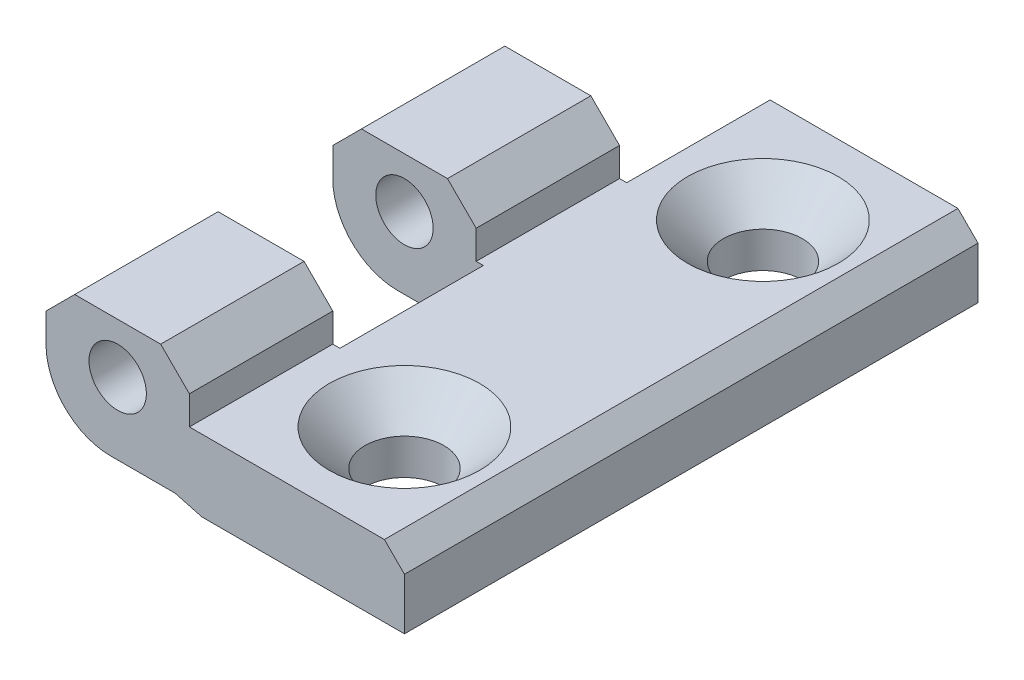
ISO-10303-21;
HEADER;
FILE_DESCRIPTION(('STEP AP214'),'2;1');
FILE_NAME('part.step','',(''),(''),'','','');
FILE_SCHEMA(('AUTOMOTIVE_DESIGN { 1 0 10303 214 1 1 1 1 }'));
ENDSEC;
DATA;
#1=APPLICATION_CONTEXT('core data for automotive mechanical design processes');
#2=APPLICATION_PROTOCOL_DEFINITION('international standard','automotive_design',2000,#1);
#3=PRODUCT_CONTEXT('',#1,'mechanical');
#4=PRODUCT('Part','Part','',(#3));
#5=PRODUCT_RELATED_PRODUCT_CATEGORY('part','',(#4));
#6=PRODUCT_DEFINITION_FORMATION('','',#4);
#7=PRODUCT_DEFINITION_CONTEXT('part definition',#1,'design');
#8=PRODUCT_DEFINITION('design','',#6,#7);
#9=PRODUCT_DEFINITION_SHAPE('','',#8);
#10=(LENGTH_UNIT() NAMED_UNIT(*) SI_UNIT(.MILLI.,.METRE.));
#11=(NAMED_UNIT(*) PLANE_ANGLE_UNIT() SI_UNIT($,.RADIAN.));
#12=(NAMED_UNIT(*) SI_UNIT($,.STERADIAN.) SOLID_ANGLE_UNIT());
#13=UNCERTAINTY_MEASURE_WITH_UNIT(LENGTH_MEASURE(1.E-05),#10,'distance_accuracy_value','');
#14=(GEOMETRIC_REPRESENTATION_CONTEXT(3) GLOBAL_UNCERTAINTY_ASSIGNED_CONTEXT((#13)) GLOBAL_UNIT_ASSIGNED_CONTEXT((#10,
#11,#12)) REPRESENTATION_CONTEXT('',''));
#15=CARTESIAN_POINT('',(0.,0.,0.));
#16=DIRECTION('',(0.,0.,1.));
#17=DIRECTION('',(1.,0.,0.));
#18=AXIS2_PLACEMENT_3D('',#15,#16,#17);
#19=CARTESIAN_POINT('',(-0.499999999999999,5.,-10.));
#20=DIRECTION('',(0.,0.,1.));
#21=DIRECTION('',(1.,0.,0.));
#22=AXIS2_PLACEMENT_3D('',#19,#20,#21);
#23=CYLINDRICAL_SURFACE('',#22,4.5);
#24=CARTESIAN_POINT('',(-0.499999999999999,5.,-10.));
#25=DIRECTION('',(0.,0.,1.));
#26=DIRECTION('',(1.,0.,0.));
#27=AXIS2_PLACEMENT_3D('',#24,#25,#26);
#28=CIRCLE('',#27,4.5);
#29=CARTESIAN_POINT('',(-0.5,0.5,-10.));
#30=VERTEX_POINT('',#29);
#31=CARTESIAN_POINT('',(-5.,5.,-10.));
#32=VERTEX_POINT('',#31);
#33=EDGE_CURVE('E19',#30,#32,#28,.F.);
#34=ORIENTED_EDGE('',*,*,#33,.F.);
#35=DIRECTION('',(0.,0.,1.));
#36=VECTOR('',#35,1.);
#37=CARTESIAN_POINT('',(-0.5,0.5,-10.));
#38=LINE('',#37,#36);
#39=CARTESIAN_POINT('',(-0.5,0.5,0.));
#40=VERTEX_POINT('',#39);
#41=EDGE_CURVE('E120',#30,#40,#38,.T.);
#42=ORIENTED_EDGE('',*,*,#41,.T.);
#43=CARTESIAN_POINT('',(-0.499999999999999,5.,0.));
#44=DIRECTION('',(0.,0.,1.));
#45=DIRECTION('',(1.,0.,0.));
#46=AXIS2_PLACEMENT_3D('',#43,#44,#45);
#47=CIRCLE('',#46,4.5);
#48=CARTESIAN_POINT('',(-5.,5.,0.));
#49=VERTEX_POINT('',#48);
#50=EDGE_CURVE('E195',#40,#49,#47,.F.);
#51=ORIENTED_EDGE('',*,*,#50,.T.);
#52=DIRECTION('',(0.,0.,-1.));
#53=VECTOR('',#52,1.);
#54=CARTESIAN_POINT('',(-5.,5.,-10.));
#55=LINE('',#54,#53);
#56=EDGE_CURVE('E122',#49,#32,#55,.T.);
#57=ORIENTED_EDGE('',*,*,#56,.T.);
#58=EDGE_LOOP('',(#34,#42,#51,#57));
#59=FACE_BOUND('',#58,.T.);
#60=ADVANCED_FACE('F16',(#59),#23,.T.);
#61=CARTESIAN_POINT('',(-5.,5.,-10.));
#62=DIRECTION('',(1.,0.,0.));
#63=DIRECTION('',(0.,0.,-1.));
#64=AXIS2_PLACEMENT_3D('',#61,#62,#63);
#65=PLANE('',#64);
#66=DIRECTION('',(0.,0.,1.));
#67=VECTOR('',#66,1.);
#68=CARTESIAN_POINT('',(-5.,7.,-10.));
#69=LINE('',#68,#67);
#70=CARTESIAN_POINT('',(-5.,7.,0.));
#71=VERTEX_POINT('',#70);
#72=CARTESIAN_POINT('',(-5.,7.,-10.));
#73=VERTEX_POINT('',#72);
#74=EDGE_CURVE('E257',#71,#73,#69,.F.);
#75=ORIENTED_EDGE('',*,*,#74,.T.);
#76=DIRECTION('',(0.,1.,0.));
#77=VECTOR('',#76,1.);
#78=CARTESIAN_POINT('',(-5.,5.,-10.));
#79=LINE('',#78,#77);
#80=EDGE_CURVE('E126',#32,#73,#79,.T.);
#81=ORIENTED_EDGE('',*,*,#80,.F.);
#82=ORIENTED_EDGE('',*,*,#56,.F.);
#83=DIRECTION('',(0.,1.,0.));
#84=VECTOR('',#83,1.);
#85=CARTESIAN_POINT('',(-5.,5.,0.));
#86=LINE('',#85,#84);
#87=EDGE_CURVE('E196',#49,#71,#86,.T.);
#88=ORIENTED_EDGE('',*,*,#87,.T.);
#89=EDGE_LOOP('',(#75,#81,#82,#88));
#90=FACE_BOUND('',#89,.T.);
#91=ADVANCED_FACE('F428',(#90),#65,.F.);
#92=CARTESIAN_POINT('',(-5.,7.,-10.));
#93=DIRECTION('',(0.707106781186548,-0.707106781186547,0.));
#94=DIRECTION('',(0.707106781186547,0.707106781186548,0.));
#95=AXIS2_PLACEMENT_3D('',#92,#93,#94);
#96=PLANE('',#95);
#97=DIRECTION('',(0.,0.,-1.));
#98=VECTOR('',#97,1.);
#99=CARTESIAN_POINT('',(-3.,9.,-10.));
#100=LINE('',#99,#98);
#101=CARTESIAN_POINT('',(-3.,9.,0.));
#102=VERTEX_POINT('',#101);
#103=CARTESIAN_POINT('',(-3.,9.,-10.));
#104=VERTEX_POINT('',#103);
#105=EDGE_CURVE('E254',#102,#104,#100,.T.);
#106=ORIENTED_EDGE('',*,*,#105,.T.);
#107=DIRECTION('',(0.707106781186547,0.707106781186548,0.));
#108=VECTOR('',#107,1.);
#109=CARTESIAN_POINT('',(-5.,7.,-10.));
#110=LINE('',#109,#108);
#111=EDGE_CURVE('E157',#73,#104,#110,.T.);
#112=ORIENTED_EDGE('',*,*,#111,.F.);
#113=ORIENTED_EDGE('',*,*,#74,.F.);
#114=DIRECTION('',(0.707106781186547,0.707106781186548,0.));
#115=VECTOR('',#114,1.);
#116=CARTESIAN_POINT('',(-5.,7.,0.));
#117=LINE('',#116,#115);
#118=EDGE_CURVE('E198',#71,#102,#117,.T.);
#119=ORIENTED_EDGE('',*,*,#118,.T.);
#120=EDGE_LOOP('',(#106,#112,#113,#119));
#121=FACE_BOUND('',#120,.T.);
#122=ADVANCED_FACE('F425',(#121),#96,.F.);
#123=CARTESIAN_POINT('',(-3.,9.,-10.));
#124=DIRECTION('',(0.,-1.,0.));
#125=DIRECTION('',(0.,0.,-1.));
#126=AXIS2_PLACEMENT_3D('',#123,#124,#125);
#127=PLANE('',#126);
#128=DIRECTION('',(0.,0.,1.));
#129=VECTOR('',#128,1.);
#130=CARTESIAN_POINT('',(3.,9.,-10.));
#131=LINE('',#130,#129);
#132=CARTESIAN_POINT('',(3.,9.,0.));
#133=VERTEX_POINT('',#132);
#134=CARTESIAN_POINT('',(3.,9.,-10.));
#135=VERTEX_POINT('',#134);
#136=EDGE_CURVE('E217',#133,#135,#131,.F.);
#137=ORIENTED_EDGE('',*,*,#136,.T.);
#138=DIRECTION('',(-1.,0.,0.));
#139=VECTOR('',#138,1.);
#140=CARTESIAN_POINT('',(-0.499999999999999,9.,-10.));
#141=LINE('',#140,#139);
#142=EDGE_CURVE('E159',#104,#135,#141,.F.);
#143=ORIENTED_EDGE('',*,*,#142,.F.);
#144=ORIENTED_EDGE('',*,*,#105,.F.);
#145=DIRECTION('',(-1.,0.,0.));
#146=VECTOR('',#145,1.);
#147=CARTESIAN_POINT('',(-0.499999999999999,9.,0.));
#148=LINE('',#147,#146);
#149=EDGE_CURVE('E261',#102,#133,#148,.F.);
#150=ORIENTED_EDGE('',*,*,#149,.T.);
#151=EDGE_LOOP('',(#137,#143,#144,#150));
#152=FACE_BOUND('',#151,.T.);
#153=ADVANCED_FACE('F417',(#152),#127,.F.);
#154=CARTESIAN_POINT('',(3.,9.,-10.));
#155=DIRECTION('',(-0.707106781186548,-0.707106781186547,0.));
#156=DIRECTION('',(0.707106781186547,-0.707106781186548,0.));
#157=AXIS2_PLACEMENT_3D('',#154,#155,#156);
#158=PLANE('',#157);
#159=DIRECTION('',(0.,0.,1.));
#160=VECTOR('',#159,1.);
#161=CARTESIAN_POINT('',(5.,7.,-10.));
#162=LINE('',#161,#160);
#163=CARTESIAN_POINT('',(5.,7.,0.));
#164=VERTEX_POINT('',#163);
#165=CARTESIAN_POINT('',(5.,7.,-10.));
#166=VERTEX_POINT('',#165);
#167=EDGE_CURVE('E214',#164,#166,#162,.F.);
#168=ORIENTED_EDGE('',*,*,#167,.T.);
#169=DIRECTION('',(0.707106781186547,-0.707106781186548,0.));
#170=VECTOR('',#169,1.);
#171=CARTESIAN_POINT('',(3.,9.,-10.));
#172=LINE('',#171,#170);
#173=EDGE_CURVE('E207',#135,#166,#172,.T.);
#174=ORIENTED_EDGE('',*,*,#173,.F.);
#175=ORIENTED_EDGE('',*,*,#136,.F.);
#176=DIRECTION('',(0.707106781186547,-0.707106781186548,0.));
#177=VECTOR('',#176,1.);
#178=CARTESIAN_POINT('',(3.,9.,0.));
#179=LINE('',#178,#177);
#180=EDGE_CURVE('E411',#133,#164,#179,.T.);
#181=ORIENTED_EDGE('',*,*,#180,.T.);
#182=EDGE_LOOP('',(#168,#174,#175,#181));
#183=FACE_BOUND('',#182,.T.);
#184=ADVANCED_FACE('F432',(#183),#158,.F.);
#185=CARTESIAN_POINT('',(0.,5.5,-10.));
#186=DIRECTION('',(0.,0.,1.));
#187=DIRECTION('',(1.,0.,0.));
#188=AXIS2_PLACEMENT_3D('',#185,#186,#187);
#189=CYLINDRICAL_SURFACE('',#188,2.);
#190=CARTESIAN_POINT('',(0.,5.5,0.));
#191=DIRECTION('',(0.,0.,1.));
#192=DIRECTION('',(1.,0.,0.));
#193=AXIS2_PLACEMENT_3D('',#190,#191,#192);
#194=CIRCLE('',#193,2.);
#195=CARTESIAN_POINT('',(2.,5.5,0.));
#196=VERTEX_POINT('',#195);
#197=EDGE_CURVE('E190',#196,#196,#194,.T.);
#198=ORIENTED_EDGE('',*,*,#197,.T.);
#199=EDGE_LOOP('',(#198));
#200=FACE_BOUND('',#199,.T.);
#201=CARTESIAN_POINT('',(0.,5.5,-10.));
#202=DIRECTION('',(0.,0.,1.));
#203=DIRECTION('',(1.,0.,0.));
#204=AXIS2_PLACEMENT_3D('',#201,#202,#203);
#205=CIRCLE('',#204,2.);
#206=CARTESIAN_POINT('',(2.,5.5,-10.));
#207=VERTEX_POINT('',#206);
#208=EDGE_CURVE('E142',#207,#207,#205,.T.);
#209=ORIENTED_EDGE('',*,*,#208,.F.);
#210=EDGE_LOOP('',(#209));
#211=FACE_BOUND('',#210,.T.);
#212=ADVANCED_FACE('F620',(#200,#211),#189,.F.);
#213=CARTESIAN_POINT('',(5.,7.,-10.));
#214=DIRECTION('',(-1.,0.,0.));
#215=DIRECTION('',(0.,0.,1.));
#216=AXIS2_PLACEMENT_3D('',#213,#214,#215);
#217=PLANE('',#216);
#218=DIRECTION('',(0.,0.,-1.));
#219=VECTOR('',#218,1.);
#220=CARTESIAN_POINT('',(5.,5.,-20.));
#221=LINE('',#220,#219);
#222=CARTESIAN_POINT('',(5.,5.00000000000001,0.));
#223=VERTEX_POINT('',#222);
#224=CARTESIAN_POINT('',(5.,5.00000000000001,-10.));
#225=VERTEX_POINT('',#224);
#226=EDGE_CURVE('E437',#223,#225,#221,.T.);
#227=ORIENTED_EDGE('',*,*,#226,.T.);
#228=DIRECTION('',(0.,1.,0.));
#229=VECTOR('',#228,1.);
#230=CARTESIAN_POINT('',(5.,5.,-10.));
#231=LINE('',#230,#229);
#232=EDGE_CURVE('E145',#166,#225,#231,.F.);
#233=ORIENTED_EDGE('',*,*,#232,.F.);
#234=ORIENTED_EDGE('',*,*,#167,.F.);
#235=DIRECTION('',(0.,1.,0.));
#236=VECTOR('',#235,1.);
#237=CARTESIAN_POINT('',(5.,5.,0.));
#238=LINE('',#237,#236);
#239=EDGE_CURVE('E409',#164,#223,#238,.F.);
#240=ORIENTED_EDGE('',*,*,#239,.T.);
#241=EDGE_LOOP('',(#227,#233,#234,#240));
#242=FACE_BOUND('',#241,.T.);
#243=ADVANCED_FACE('F435',(#242),#217,.F.);
#244=CARTESIAN_POINT('',(-0.499999999999999,5.,-10.));
#245=DIRECTION('',(0.,0.,-1.));
#246=DIRECTION('',(-1.,0.,0.));
#247=AXIS2_PLACEMENT_3D('',#244,#245,#246);
#248=PLANE('',#247);
#249=ORIENTED_EDGE('',*,*,#208,.T.);
#250=EDGE_LOOP('',(#249));
#251=FACE_BOUND('',#250,.T.);
#252=ORIENTED_EDGE('',*,*,#232,.T.);
#253=DIRECTION('',(1.,0.,0.));
#254=VECTOR('',#253,1.);
#255=CARTESIAN_POINT('',(5.5,5.,-10.));
#256=LINE('',#255,#254);
#257=CARTESIAN_POINT('',(5.5,5.,-10.));
#258=VERTEX_POINT('',#257);
#259=EDGE_CURVE('E440',#225,#258,#256,.T.);
#260=ORIENTED_EDGE('',*,*,#259,.T.);
#261=DIRECTION('',(-0.099503719020999,0.995037190209989,0.));
#262=VECTOR('',#261,1.);
#263=CARTESIAN_POINT('',(6.,0.,-10.));
#264=LINE('',#263,#262);
#265=CARTESIAN_POINT('',(6.,0.,-10.));
#266=VERTEX_POINT('',#265);
#267=EDGE_CURVE('E154',#258,#266,#264,.F.);
#268=ORIENTED_EDGE('',*,*,#267,.T.);
#269=DIRECTION('',(-1.,0.,0.));
#270=VECTOR('',#269,1.);
#271=CARTESIAN_POINT('',(-0.499999999999999,0.,-10.));
#272=LINE('',#271,#270);
#273=CARTESIAN_POINT('',(5.86602540378444,0.,-10.));
#274=VERTEX_POINT('',#273);
#275=EDGE_CURVE('E127',#266,#274,#272,.T.);
#276=ORIENTED_EDGE('',*,*,#275,.T.);
#277=DIRECTION('',(-0.965925826289068,0.258819045102521,0.));
#278=VECTOR('',#277,1.);
#279=CARTESIAN_POINT('',(5.86602540378444,0.,-10.));
#280=LINE('',#279,#278);
#281=CARTESIAN_POINT('',(4.,0.5,-10.));
#282=VERTEX_POINT('',#281);
#283=EDGE_CURVE('E141',#274,#282,#280,.T.);
#284=ORIENTED_EDGE('',*,*,#283,.T.);
#285=DIRECTION('',(1.,0.,0.));
#286=VECTOR('',#285,1.);
#287=CARTESIAN_POINT('',(4.,0.5,-10.));
#288=LINE('',#287,#286);
#289=EDGE_CURVE('E132',#282,#30,#288,.F.);
#290=ORIENTED_EDGE('',*,*,#289,.T.);
#291=ORIENTED_EDGE('',*,*,#33,.T.);
#292=ORIENTED_EDGE('',*,*,#80,.T.);
#293=ORIENTED_EDGE('',*,*,#111,.T.);
#294=ORIENTED_EDGE('',*,*,#142,.T.);
#295=ORIENTED_EDGE('',*,*,#173,.T.);
#296=EDGE_LOOP('',(#252,#260,#268,#276,#284,#290,#291,#292,#293,#294,#295));
#297=FACE_BOUND('',#296,.T.);
#298=ADVANCED_FACE('F138',(#251,#297),#248,.T.);
#299=CARTESIAN_POINT('',(4.,0.5,-10.));
#300=DIRECTION('',(0.,1.,0.));
#301=DIRECTION('',(0.,0.,1.));
#302=AXIS2_PLACEMENT_3D('',#299,#300,#301);
#303=PLANE('',#302);
#304=ORIENTED_EDGE('',*,*,#41,.F.);
#305=ORIENTED_EDGE('',*,*,#289,.F.);
#306=DIRECTION('',(0.,0.,1.));
#307=VECTOR('',#306,1.);
#308=CARTESIAN_POINT('',(4.,0.499999999999999,-10.));
#309=LINE('',#308,#307);
#310=CARTESIAN_POINT('',(4.00000000000001,0.499999999999999,0.));
#311=VERTEX_POINT('',#310);
#312=EDGE_CURVE('E153',#282,#311,#309,.T.);
#313=ORIENTED_EDGE('',*,*,#312,.T.);
#314=DIRECTION('',(-1.,0.,0.));
#315=VECTOR('',#314,1.);
#316=CARTESIAN_POINT('',(-0.499999999999999,0.5,0.));
#317=LINE('',#316,#315);
#318=EDGE_CURVE('E134',#311,#40,#317,.T.);
#319=ORIENTED_EDGE('',*,*,#318,.T.);
#320=EDGE_LOOP('',(#304,#305,#313,#319));
#321=FACE_BOUND('',#320,.T.);
#322=ADVANCED_FACE('F130',(#321),#303,.F.);
#323=CARTESIAN_POINT('',(-0.499999999999999,5.,0.));
#324=DIRECTION('',(0.,0.,-1.));
#325=DIRECTION('',(-1.,0.,0.));
#326=AXIS2_PLACEMENT_3D('',#323,#324,#325);
#327=PLANE('',#326);
#328=ORIENTED_EDGE('',*,*,#197,.F.);
#329=EDGE_LOOP('',(#328));
#330=FACE_BOUND('',#329,.T.);
#331=DIRECTION('',(-0.099503719020999,0.995037190209989,0.));
#332=VECTOR('',#331,1.);
#333=CARTESIAN_POINT('',(6.,0.,0.));
#334=LINE('',#333,#332);
#335=CARTESIAN_POINT('',(6.,0.,0.));
#336=VERTEX_POINT('',#335);
#337=CARTESIAN_POINT('',(5.5,5.00000000000001,0.));
#338=VERTEX_POINT('',#337);
#339=EDGE_CURVE('E271',#336,#338,#334,.T.);
#340=ORIENTED_EDGE('',*,*,#339,.T.);
#341=DIRECTION('',(1.,0.,0.));
#342=VECTOR('',#341,1.);
#343=CARTESIAN_POINT('',(5.5,5.,0.));
#344=LINE('',#343,#342);
#345=EDGE_CURVE('E441',#338,#223,#344,.F.);
#346=ORIENTED_EDGE('',*,*,#345,.T.);
#347=ORIENTED_EDGE('',*,*,#239,.F.);
#348=ORIENTED_EDGE('',*,*,#180,.F.);
#349=ORIENTED_EDGE('',*,*,#149,.F.);
#350=ORIENTED_EDGE('',*,*,#118,.F.);
#351=ORIENTED_EDGE('',*,*,#87,.F.);
#352=ORIENTED_EDGE('',*,*,#50,.F.);
#353=ORIENTED_EDGE('',*,*,#318,.F.);
#354=DIRECTION('',(-0.965925826289068,0.258819045102521,0.));
#355=VECTOR('',#354,1.);
#356=CARTESIAN_POINT('',(5.86602540378444,0.,0.));
#357=LINE('',#356,#355);
#358=CARTESIAN_POINT('',(5.86602540378443,0.,0.));
#359=VERTEX_POINT('',#358);
#360=EDGE_CURVE('E268',#311,#359,#357,.F.);
#361=ORIENTED_EDGE('',*,*,#360,.T.);
#362=DIRECTION('',(-1.,0.,0.));
#363=VECTOR('',#362,1.);
#364=CARTESIAN_POINT('',(-0.499999999999999,0.,0.));
#365=LINE('',#364,#363);
#366=EDGE_CURVE('E194',#336,#359,#365,.T.);
#367=ORIENTED_EDGE('',*,*,#366,.F.);
#368=EDGE_LOOP('',(#340,#346,#347,#348,#349,#350,#351,#352,#353,#361,#367));
#369=FACE_BOUND('',#368,.T.);
#370=ADVANCED_FACE('F283',(#330,#369),#327,.F.);
#371=CARTESIAN_POINT('',(-0.499999999999999,5.,10.));
#372=DIRECTION('',(0.,0.,-1.));
#373=DIRECTION('',(-1.,0.,0.));
#374=AXIS2_PLACEMENT_3D('',#371,#372,#373);
#375=PLANE('',#374);
#376=CARTESIAN_POINT('',(0.,5.5,10.));
#377=DIRECTION('',(0.,0.,-1.));
#378=DIRECTION('',(-1.,0.,0.));
#379=AXIS2_PLACEMENT_3D('',#376,#377,#378);
#380=CIRCLE('',#379,2.);
#381=CARTESIAN_POINT('',(-2.,5.5,10.));
#382=VERTEX_POINT('',#381);
#383=EDGE_CURVE('E182',#382,#382,#380,.F.);
#384=ORIENTED_EDGE('',*,*,#383,.T.);
#385=EDGE_LOOP('',(#384));
#386=FACE_BOUND('',#385,.T.);
#387=DIRECTION('',(0.,1.,0.));
#388=VECTOR('',#387,1.);
#389=CARTESIAN_POINT('',(5.,7.,10.));
#390=LINE('',#389,#388);
#391=CARTESIAN_POINT('',(5.,5.00000000000001,10.));
#392=VERTEX_POINT('',#391);
#393=CARTESIAN_POINT('',(5.,7.,10.));
#394=VERTEX_POINT('',#393);
#395=EDGE_CURVE('E345',#392,#394,#390,.T.);
#396=ORIENTED_EDGE('',*,*,#395,.F.);
#397=DIRECTION('',(1.,0.,0.));
#398=VECTOR('',#397,1.);
#399=CARTESIAN_POINT('',(5.5,5.,10.));
#400=LINE('',#399,#398);
#401=CARTESIAN_POINT('',(5.5,5.,10.));
#402=VERTEX_POINT('',#401);
#403=EDGE_CURVE('E444',#392,#402,#400,.T.);
#404=ORIENTED_EDGE('',*,*,#403,.T.);
#405=DIRECTION('',(-0.099503719020999,0.995037190209989,0.));
#406=VECTOR('',#405,1.);
#407=CARTESIAN_POINT('',(6.,0.,10.));
#408=LINE('',#407,#406);
#409=CARTESIAN_POINT('',(6.,0.,10.));
#410=VERTEX_POINT('',#409);
#411=EDGE_CURVE('E238',#402,#410,#408,.F.);
#412=ORIENTED_EDGE('',*,*,#411,.T.);
#413=DIRECTION('',(-1.,0.,0.));
#414=VECTOR('',#413,1.);
#415=CARTESIAN_POINT('',(-0.499999999999999,0.,10.));
#416=LINE('',#415,#414);
#417=CARTESIAN_POINT('',(5.86602540378444,0.,10.));
#418=VERTEX_POINT('',#417);
#419=EDGE_CURVE('E193',#410,#418,#416,.T.);
#420=ORIENTED_EDGE('',*,*,#419,.T.);
#421=DIRECTION('',(0.965925826289068,-0.258819045102521,0.));
#422=VECTOR('',#421,1.);
#423=CARTESIAN_POINT('',(5.86602540378444,0.,10.));
#424=LINE('',#423,#422);
#425=CARTESIAN_POINT('',(4.,0.5,10.));
#426=VERTEX_POINT('',#425);
#427=EDGE_CURVE('E241',#426,#418,#424,.T.);
#428=ORIENTED_EDGE('',*,*,#427,.F.);
#429=DIRECTION('',(1.,0.,0.));
#430=VECTOR('',#429,1.);
#431=CARTESIAN_POINT('',(4.,0.5,10.));
#432=LINE('',#431,#430);
#433=CARTESIAN_POINT('',(-0.499999999999999,0.5,10.));
#434=VERTEX_POINT('',#433);
#435=EDGE_CURVE('E189',#434,#426,#432,.T.);
#436=ORIENTED_EDGE('',*,*,#435,.F.);
#437=CARTESIAN_POINT('',(-0.499999999999999,5.,10.));
#438=DIRECTION('',(0.,0.,-1.));
#439=DIRECTION('',(-1.,0.,0.));
#440=AXIS2_PLACEMENT_3D('',#437,#438,#439);
#441=CIRCLE('',#440,4.5);
#442=CARTESIAN_POINT('',(-5.,5.,10.));
#443=VERTEX_POINT('',#442);
#444=EDGE_CURVE('E186',#443,#434,#441,.F.);
#445=ORIENTED_EDGE('',*,*,#444,.F.);
#446=DIRECTION('',(0.,1.,0.));
#447=VECTOR('',#446,1.);
#448=CARTESIAN_POINT('',(-5.,5.,10.));
#449=LINE('',#448,#447);
#450=CARTESIAN_POINT('',(-5.,7.,10.));
#451=VERTEX_POINT('',#450);
#452=EDGE_CURVE('E218',#451,#443,#449,.F.);
#453=ORIENTED_EDGE('',*,*,#452,.F.);
#454=DIRECTION('',(-0.707106781186547,-0.707106781186548,0.));
#455=VECTOR('',#454,1.);
#456=CARTESIAN_POINT('',(-5.,7.,10.));
#457=LINE('',#456,#455);
#458=CARTESIAN_POINT('',(-3.,9.,10.));
#459=VERTEX_POINT('',#458);
#460=EDGE_CURVE('E223',#459,#451,#457,.T.);
#461=ORIENTED_EDGE('',*,*,#460,.F.);
#462=DIRECTION('',(1.,0.,0.));
#463=VECTOR('',#462,1.);
#464=CARTESIAN_POINT('',(-3.,9.,10.));
#465=LINE('',#464,#463);
#466=CARTESIAN_POINT('',(3.,9.,10.));
#467=VERTEX_POINT('',#466);
#468=EDGE_CURVE('E228',#467,#459,#465,.F.);
#469=ORIENTED_EDGE('',*,*,#468,.F.);
#470=DIRECTION('',(-0.707106781186547,0.707106781186548,0.));
#471=VECTOR('',#470,1.);
#472=CARTESIAN_POINT('',(3.,9.,10.));
#473=LINE('',#472,#471);
#474=EDGE_CURVE('E235',#394,#467,#473,.T.);
#475=ORIENTED_EDGE('',*,*,#474,.F.);
#476=EDGE_LOOP('',(#396,#404,#412,#420,#428,#436,#445,#453,#461,#469,#475));
#477=FACE_BOUND('',#476,.T.);
#478=ADVANCED_FACE('F360',(#386,#477),#375,.T.);
#479=CARTESIAN_POINT('',(4.,0.5,20.));
#480=DIRECTION('',(0.,-1.,0.));
#481=DIRECTION('',(0.,0.,-1.));
#482=AXIS2_PLACEMENT_3D('',#479,#480,#481);
#483=PLANE('',#482);
#484=DIRECTION('',(-1.,0.,0.));
#485=VECTOR('',#484,1.);
#486=CARTESIAN_POINT('',(0.,0.5,20.));
#487=LINE('',#486,#485);
#488=CARTESIAN_POINT('',(4.,0.5,20.));
#489=VERTEX_POINT('',#488);
#490=CARTESIAN_POINT('',(-0.499999999999999,0.5,20.));
#491=VERTEX_POINT('',#490);
#492=EDGE_CURVE('E174',#489,#491,#487,.T.);
#493=ORIENTED_EDGE('',*,*,#492,.T.);
#494=DIRECTION('',(0.,0.,-1.));
#495=VECTOR('',#494,1.);
#496=CARTESIAN_POINT('',(-0.499999999999998,0.5,20.));
#497=LINE('',#496,#495);
#498=EDGE_CURVE('E188',#434,#491,#497,.F.);
#499=ORIENTED_EDGE('',*,*,#498,.F.);
#500=ORIENTED_EDGE('',*,*,#435,.T.);
#501=DIRECTION('',(0.,0.,1.));
#502=VECTOR('',#501,1.);
#503=CARTESIAN_POINT('',(4.,0.499999999999999,20.));
#504=LINE('',#503,#502);
#505=EDGE_CURVE('E386',#489,#426,#504,.F.);
#506=ORIENTED_EDGE('',*,*,#505,.F.);
#507=EDGE_LOOP('',(#493,#499,#500,#506));
#508=FACE_BOUND('',#507,.T.);
#509=ADVANCED_FACE('F602',(#508),#483,.T.);
#510=CARTESIAN_POINT('',(-0.499999999999999,5.,20.));
#511=DIRECTION('',(0.,0.,-1.));
#512=DIRECTION('',(-1.,0.,0.));
#513=AXIS2_PLACEMENT_3D('',#510,#511,#512);
#514=CYLINDRICAL_SURFACE('',#513,4.5);
#515=CARTESIAN_POINT('',(-0.499999999999999,5.,20.));
#516=DIRECTION('',(0.,0.,-1.));
#517=DIRECTION('',(-1.,0.,0.));
#518=AXIS2_PLACEMENT_3D('',#515,#516,#517);
#519=CIRCLE('',#518,4.5);
#520=CARTESIAN_POINT('',(-5.,5.,20.));
#521=VERTEX_POINT('',#520);
#522=EDGE_CURVE('E170',#491,#521,#519,.T.);
#523=ORIENTED_EDGE('',*,*,#522,.T.);
#524=DIRECTION('',(0.,0.,1.));
#525=VECTOR('',#524,1.);
#526=CARTESIAN_POINT('',(-5.,5.,20.));
#527=LINE('',#526,#525);
#528=EDGE_CURVE('E220',#443,#521,#527,.T.);
#529=ORIENTED_EDGE('',*,*,#528,.F.);
#530=ORIENTED_EDGE('',*,*,#444,.T.);
#531=ORIENTED_EDGE('',*,*,#498,.T.);
#532=EDGE_LOOP('',(#523,#529,#530,#531));
#533=FACE_BOUND('',#532,.T.);
#534=ADVANCED_FACE('F598',(#533),#514,.T.);
#535=CARTESIAN_POINT('',(-5.,5.,20.));
#536=DIRECTION('',(-1.,0.,0.));
#537=DIRECTION('',(0.,0.,1.));
#538=AXIS2_PLACEMENT_3D('',#535,#536,#537);
#539=PLANE('',#538);
#540=DIRECTION('',(0.,1.,0.));
#541=VECTOR('',#540,1.);
#542=CARTESIAN_POINT('',(-5.,0.,20.));
#543=LINE('',#542,#541);
#544=CARTESIAN_POINT('',(-5.,7.,20.));
#545=VERTEX_POINT('',#544);
#546=EDGE_CURVE('E173',#521,#545,#543,.T.);
#547=ORIENTED_EDGE('',*,*,#546,.T.);
#548=DIRECTION('',(0.,0.,1.));
#549=VECTOR('',#548,1.);
#550=CARTESIAN_POINT('',(-5.,7.,20.));
#551=LINE('',#550,#549);
#552=EDGE_CURVE('E225',#451,#545,#551,.T.);
#553=ORIENTED_EDGE('',*,*,#552,.F.);
#554=ORIENTED_EDGE('',*,*,#452,.T.);
#555=ORIENTED_EDGE('',*,*,#528,.T.);
#556=EDGE_LOOP('',(#547,#553,#554,#555));
#557=FACE_BOUND('',#556,.T.);
#558=ADVANCED_FACE('F594',(#557),#539,.T.);
#559=CARTESIAN_POINT('',(-5.,7.,20.));
#560=DIRECTION('',(-0.707106781186548,0.707106781186547,0.));
#561=DIRECTION('',(-0.707106781186547,-0.707106781186548,0.));
#562=AXIS2_PLACEMENT_3D('',#559,#560,#561);
#563=PLANE('',#562);
#564=DIRECTION('',(0.707106781186547,0.707106781186548,0.));
#565=VECTOR('',#564,1.);
#566=CARTESIAN_POINT('',(-5.,7.,20.));
#567=LINE('',#566,#565);
#568=CARTESIAN_POINT('',(-3.,9.,20.));
#569=VERTEX_POINT('',#568);
#570=EDGE_CURVE('E373',#545,#569,#567,.T.);
#571=ORIENTED_EDGE('',*,*,#570,.T.);
#572=DIRECTION('',(0.,0.,1.));
#573=VECTOR('',#572,1.);
#574=CARTESIAN_POINT('',(-3.,9.,20.));
#575=LINE('',#574,#573);
#576=EDGE_CURVE('E230',#459,#569,#575,.T.);
#577=ORIENTED_EDGE('',*,*,#576,.F.);
#578=ORIENTED_EDGE('',*,*,#460,.T.);
#579=ORIENTED_EDGE('',*,*,#552,.T.);
#580=EDGE_LOOP('',(#571,#577,#578,#579));
#581=FACE_BOUND('',#580,.T.);
#582=ADVANCED_FACE('F591',(#581),#563,.T.);
#583=CARTESIAN_POINT('',(-3.,9.,20.));
#584=DIRECTION('',(0.,1.,0.));
#585=DIRECTION('',(0.,0.,1.));
#586=AXIS2_PLACEMENT_3D('',#583,#584,#585);
#587=PLANE('',#586);
#588=DIRECTION('',(-1.,0.,0.));
#589=VECTOR('',#588,1.);
#590=CARTESIAN_POINT('',(0.,9.,20.));
#591=LINE('',#590,#589);
#592=CARTESIAN_POINT('',(3.,9.,20.));
#593=VERTEX_POINT('',#592);
#594=EDGE_CURVE('E367',#569,#593,#591,.F.);
#595=ORIENTED_EDGE('',*,*,#594,.T.);
#596=DIRECTION('',(0.,0.,1.));
#597=VECTOR('',#596,1.);
#598=CARTESIAN_POINT('',(3.,9.,20.));
#599=LINE('',#598,#597);
#600=EDGE_CURVE('E354',#467,#593,#599,.T.);
#601=ORIENTED_EDGE('',*,*,#600,.F.);
#602=ORIENTED_EDGE('',*,*,#468,.T.);
#603=ORIENTED_EDGE('',*,*,#576,.T.);
#604=EDGE_LOOP('',(#595,#601,#602,#603));
#605=FACE_BOUND('',#604,.T.);
#606=ADVANCED_FACE('F365',(#605),#587,.T.);
#607=CARTESIAN_POINT('',(3.,9.,20.));
#608=DIRECTION('',(0.707106781186548,0.707106781186547,0.));
#609=DIRECTION('',(-0.707106781186547,0.707106781186548,0.));
#610=AXIS2_PLACEMENT_3D('',#607,#608,#609);
#611=PLANE('',#610);
#612=DIRECTION('',(0.707106781186547,-0.707106781186548,0.));
#613=VECTOR('',#612,1.);
#614=CARTESIAN_POINT('',(3.,9.,20.));
#615=LINE('',#614,#613);
#616=CARTESIAN_POINT('',(5.,7.,20.));
#617=VERTEX_POINT('',#616);
#618=EDGE_CURVE('E456',#593,#617,#615,.T.);
#619=ORIENTED_EDGE('',*,*,#618,.T.);
#620=DIRECTION('',(0.,0.,-1.));
#621=VECTOR('',#620,1.);
#622=CARTESIAN_POINT('',(5.,7.,20.));
#623=LINE('',#622,#621);
#624=EDGE_CURVE('E356',#394,#617,#623,.F.);
#625=ORIENTED_EDGE('',*,*,#624,.F.);
#626=ORIENTED_EDGE('',*,*,#474,.T.);
#627=ORIENTED_EDGE('',*,*,#600,.T.);
#628=EDGE_LOOP('',(#619,#625,#626,#627));
#629=FACE_BOUND('',#628,.T.);
#630=ADVANCED_FACE('F352',(#629),#611,.T.);
#631=CARTESIAN_POINT('',(5.,7.,20.));
#632=DIRECTION('',(1.,0.,0.));
#633=DIRECTION('',(0.,0.,-1.));
#634=AXIS2_PLACEMENT_3D('',#631,#632,#633);
#635=PLANE('',#634);
#636=DIRECTION('',(0.,1.,0.));
#637=VECTOR('',#636,1.);
#638=CARTESIAN_POINT('',(5.,0.,20.));
#639=LINE('',#638,#637);
#640=CARTESIAN_POINT('',(5.,5.00000000000001,20.));
#641=VERTEX_POINT('',#640);
#642=EDGE_CURVE('E453',#617,#641,#639,.F.);
#643=ORIENTED_EDGE('',*,*,#642,.T.);
#644=DIRECTION('',(0.,0.,-1.));
#645=VECTOR('',#644,1.);
#646=CARTESIAN_POINT('',(5.,5.,-20.));
#647=LINE('',#646,#645);
#648=EDGE_CURVE('E449',#641,#392,#647,.T.);
#649=ORIENTED_EDGE('',*,*,#648,.T.);
#650=ORIENTED_EDGE('',*,*,#395,.T.);
#651=ORIENTED_EDGE('',*,*,#624,.T.);
#652=EDGE_LOOP('',(#643,#649,#650,#651));
#653=FACE_BOUND('',#652,.T.);
#654=ADVANCED_FACE('F452',(#653),#635,.T.);
#655=CARTESIAN_POINT('',(5.5,5.,-20.));
#656=DIRECTION('',(0.,-1.,0.));
#657=DIRECTION('',(0.,0.,-1.));
#658=AXIS2_PLACEMENT_3D('',#655,#656,#657);
#659=PLANE('',#658);
#660=CARTESIAN_POINT('',(12.5,4.99999999999545,12.5));
#661=DIRECTION('',(0.,1.,0.));
#662=DIRECTION('',(0.,0.,1.));
#663=AXIS2_PLACEMENT_3D('',#660,#661,#662);
#664=CIRCLE('',#663,5.25000000000091);
#665=CARTESIAN_POINT('',(12.5,4.99999999999545,17.7500000000009));
#666=VERTEX_POINT('',#665);
#667=EDGE_CURVE('E175',#666,#666,#664,.F.);
#668=ORIENTED_EDGE('',*,*,#667,.T.);
#669=EDGE_LOOP('',(#668));
#670=FACE_BOUND('',#669,.T.);
#671=CARTESIAN_POINT('',(12.5,4.99999999999545,-12.5));
#672=DIRECTION('',(0.,1.,0.));
#673=DIRECTION('',(0.,0.,1.));
#674=AXIS2_PLACEMENT_3D('',#671,#672,#673);
#675=CIRCLE('',#674,5.24999999992133);
#676=CARTESIAN_POINT('',(12.5,4.99999999999545,-7.25000000007867));
#677=VERTEX_POINT('',#676);
#678=EDGE_CURVE('E179',#677,#677,#675,.F.);
#679=ORIENTED_EDGE('',*,*,#678,.T.);
#680=EDGE_LOOP('',(#679));
#681=FACE_BOUND('',#680,.T.);
#682=DIRECTION('',(0.,0.,1.));
#683=VECTOR('',#682,1.);
#684=CARTESIAN_POINT('',(18.6,5.,-20.));
#685=LINE('',#684,#683);
#686=CARTESIAN_POINT('',(18.6,5.,20.));
#687=VERTEX_POINT('',#686);
#688=CARTESIAN_POINT('',(18.6,5.,-20.));
#689=VERTEX_POINT('',#688);
#690=EDGE_CURVE('E185',#687,#689,#685,.F.);
#691=ORIENTED_EDGE('',*,*,#690,.T.);
#692=DIRECTION('',(-1.,0.,0.));
#693=VECTOR('',#692,1.);
#694=CARTESIAN_POINT('',(0.,5.,-20.));
#695=LINE('',#694,#693);
#696=CARTESIAN_POINT('',(5.5,5.,-20.));
#697=VERTEX_POINT('',#696);
#698=EDGE_CURVE('E489',#697,#689,#695,.F.);
#699=ORIENTED_EDGE('',*,*,#698,.F.);
#700=DIRECTION('',(0.,0.,1.));
#701=VECTOR('',#700,1.);
#702=CARTESIAN_POINT('',(5.5,5.,-20.));
#703=LINE('',#702,#701);
#704=EDGE_CURVE('E480',#697,#258,#703,.T.);
#705=ORIENTED_EDGE('',*,*,#704,.T.);
#706=ORIENTED_EDGE('',*,*,#259,.F.);
#707=ORIENTED_EDGE('',*,*,#226,.F.);
#708=ORIENTED_EDGE('',*,*,#345,.F.);
#709=DIRECTION('',(0.,0.,1.));
#710=VECTOR('',#709,1.);
#711=CARTESIAN_POINT('',(5.5,5.00000000000001,-20.));
#712=LINE('',#711,#710);
#713=EDGE_CURVE('E242',#338,#402,#712,.T.);
#714=ORIENTED_EDGE('',*,*,#713,.T.);
#715=ORIENTED_EDGE('',*,*,#403,.F.);
#716=ORIENTED_EDGE('',*,*,#648,.F.);
#717=DIRECTION('',(-1.,0.,0.));
#718=VECTOR('',#717,1.);
#719=CARTESIAN_POINT('',(0.,5.00000000000001,20.));
#720=LINE('',#719,#718);
#721=EDGE_CURVE('E459',#641,#687,#720,.F.);
#722=ORIENTED_EDGE('',*,*,#721,.T.);
#723=EDGE_LOOP('',(#691,#699,#705,#706,#707,#708,#714,#715,#716,#722));
#724=FACE_BOUND('',#723,.T.);
#725=ADVANCED_FACE('F501',(#670,#681,#724),#659,.F.);
#726=CARTESIAN_POINT('',(18.6,5.,-20.));
#727=DIRECTION('',(-0.707106781186548,-0.707106781186547,0.));
#728=DIRECTION('',(0.707106781186547,-0.707106781186548,0.));
#729=AXIS2_PLACEMENT_3D('',#726,#727,#728);
#730=PLANE('',#729);
#731=DIRECTION('',(0.,0.,1.));
#732=VECTOR('',#731,1.);
#733=CARTESIAN_POINT('',(20.,3.6,-20.));
#734=LINE('',#733,#732);
#735=CARTESIAN_POINT('',(20.,3.6,20.));
#736=VERTEX_POINT('',#735);
#737=CARTESIAN_POINT('',(20.,3.6,-20.));
#738=VERTEX_POINT('',#737);
#739=EDGE_CURVE('E178',#736,#738,#734,.F.);
#740=ORIENTED_EDGE('',*,*,#739,.T.);
#741=DIRECTION('',(0.707106781186547,-0.707106781186548,0.));
#742=VECTOR('',#741,1.);
#743=CARTESIAN_POINT('',(18.6,5.,-20.));
#744=LINE('',#743,#742);
#745=EDGE_CURVE('E486',#689,#738,#744,.T.);
#746=ORIENTED_EDGE('',*,*,#745,.F.);
#747=ORIENTED_EDGE('',*,*,#690,.F.);
#748=DIRECTION('',(0.707106781186547,-0.707106781186548,0.));
#749=VECTOR('',#748,1.);
#750=CARTESIAN_POINT('',(18.6,5.,20.));
#751=LINE('',#750,#749);
#752=EDGE_CURVE('E169',#687,#736,#751,.T.);
#753=ORIENTED_EDGE('',*,*,#752,.T.);
#754=EDGE_LOOP('',(#740,#746,#747,#753));
#755=FACE_BOUND('',#754,.T.);
#756=ADVANCED_FACE('F505',(#755),#730,.F.);
#757=CARTESIAN_POINT('',(0.,5.5,20.));
#758=DIRECTION('',(0.,0.,-1.));
#759=DIRECTION('',(-1.,0.,0.));
#760=AXIS2_PLACEMENT_3D('',#757,#758,#759);
#761=CYLINDRICAL_SURFACE('',#760,2.);
#762=ORIENTED_EDGE('',*,*,#383,.F.);
#763=EDGE_LOOP('',(#762));
#764=FACE_BOUND('',#763,.T.);
#765=CARTESIAN_POINT('',(0.,5.5,20.));
#766=DIRECTION('',(0.,0.,-1.));
#767=DIRECTION('',(-1.,0.,0.));
#768=AXIS2_PLACEMENT_3D('',#765,#766,#767);
#769=CIRCLE('',#768,2.);
#770=CARTESIAN_POINT('',(-2.,5.5,20.));
#771=VERTEX_POINT('',#770);
#772=EDGE_CURVE('E165',#771,#771,#769,.F.);
#773=ORIENTED_EDGE('',*,*,#772,.T.);
#774=EDGE_LOOP('',(#773));
#775=FACE_BOUND('',#774,.T.);
#776=ADVANCED_FACE('F566',(#764,#775),#761,.F.);
#777=CARTESIAN_POINT('',(12.5,4.99999999999545,-12.5));
#778=DIRECTION('',(0.,1.,0.));
#779=DIRECTION('',(0.,0.,1.));
#780=AXIS2_PLACEMENT_3D('',#777,#778,#779);
#781=CONICAL_SURFACE('',#780,5.24999999992133,0.78539816338608);
#782=ORIENTED_EDGE('',*,*,#678,.F.);
#783=EDGE_LOOP('',(#782));
#784=FACE_BOUND('',#783,.T.);
#785=CARTESIAN_POINT('',(12.5,2.5,-12.5));
#786=DIRECTION('',(0.,-1.,0.));
#787=DIRECTION('',(0.,0.,-1.));
#788=AXIS2_PLACEMENT_3D('',#785,#786,#787);
#789=CIRCLE('',#788,2.75);
#790=CARTESIAN_POINT('',(12.5,2.5,-15.25));
#791=VERTEX_POINT('',#790);
#792=EDGE_CURVE('E168',#791,#791,#789,.T.);
#793=ORIENTED_EDGE('',*,*,#792,.T.);
#794=EDGE_LOOP('',(#793));
#795=FACE_BOUND('',#794,.T.);
#796=ADVANCED_FACE('F568',(#784,#795),#781,.F.);
#797=CARTESIAN_POINT('',(12.5,4.99999999999545,12.5));
#798=DIRECTION('',(0.,1.,0.));
#799=DIRECTION('',(0.,0.,1.));
#800=AXIS2_PLACEMENT_3D('',#797,#798,#799);
#801=CONICAL_SURFACE('',#800,5.25000000000091,0.78539816338608);
#802=ORIENTED_EDGE('',*,*,#667,.F.);
#803=EDGE_LOOP('',(#802));
#804=FACE_BOUND('',#803,.T.);
#805=CARTESIAN_POINT('',(12.5,2.5,12.5));
#806=DIRECTION('',(0.,-1.,0.));
#807=DIRECTION('',(0.,0.,-1.));
#808=AXIS2_PLACEMENT_3D('',#805,#806,#807);
#809=CIRCLE('',#808,2.75);
#810=CARTESIAN_POINT('',(12.5,2.5,9.75));
#811=VERTEX_POINT('',#810);
#812=EDGE_CURVE('E494',#811,#811,#809,.T.);
#813=ORIENTED_EDGE('',*,*,#812,.T.);
#814=EDGE_LOOP('',(#813));
#815=FACE_BOUND('',#814,.T.);
#816=ADVANCED_FACE('F575',(#804,#815),#801,.F.);
#817=CARTESIAN_POINT('',(20.,3.6,-20.));
#818=DIRECTION('',(-1.,0.,0.));
#819=DIRECTION('',(0.,0.,1.));
#820=AXIS2_PLACEMENT_3D('',#817,#818,#819);
#821=PLANE('',#820);
#822=DIRECTION('',(0.,0.,1.));
#823=VECTOR('',#822,1.);
#824=CARTESIAN_POINT('',(20.,0.,-20.));
#825=LINE('',#824,#823);
#826=CARTESIAN_POINT('',(20.,0.,20.));
#827=VERTEX_POINT('',#826);
#828=CARTESIAN_POINT('',(20.,0.,-20.));
#829=VERTEX_POINT('',#828);
#830=EDGE_CURVE('E497',#827,#829,#825,.F.);
#831=ORIENTED_EDGE('',*,*,#830,.T.);
#832=DIRECTION('',(0.,1.,0.));
#833=VECTOR('',#832,1.);
#834=CARTESIAN_POINT('',(20.,0.,-20.));
#835=LINE('',#834,#833);
#836=EDGE_CURVE('E491',#738,#829,#835,.F.);
#837=ORIENTED_EDGE('',*,*,#836,.F.);
#838=ORIENTED_EDGE('',*,*,#739,.F.);
#839=DIRECTION('',(0.,1.,0.));
#840=VECTOR('',#839,1.);
#841=CARTESIAN_POINT('',(20.,0.,20.));
#842=LINE('',#841,#840);
#843=EDGE_CURVE('E383',#736,#827,#842,.F.);
#844=ORIENTED_EDGE('',*,*,#843,.T.);
#845=EDGE_LOOP('',(#831,#837,#838,#844));
#846=FACE_BOUND('',#845,.T.);
#847=ADVANCED_FACE('F513',(#846),#821,.F.);
#848=CARTESIAN_POINT('',(0.,0.,-20.));
#849=DIRECTION('',(0.,0.,-1.));
#850=DIRECTION('',(-1.,0.,0.));
#851=AXIS2_PLACEMENT_3D('',#848,#849,#850);
#852=PLANE('',#851);
#853=ORIENTED_EDGE('',*,*,#698,.T.);
#854=ORIENTED_EDGE('',*,*,#745,.T.);
#855=ORIENTED_EDGE('',*,*,#836,.T.);
#856=DIRECTION('',(1.,0.,0.));
#857=VECTOR('',#856,1.);
#858=CARTESIAN_POINT('',(20.,0.,-20.));
#859=LINE('',#858,#857);
#860=CARTESIAN_POINT('',(6.,0.,-20.));
#861=VERTEX_POINT('',#860);
#862=EDGE_CURVE('E515',#829,#861,#859,.F.);
#863=ORIENTED_EDGE('',*,*,#862,.T.);
#864=DIRECTION('',(-0.099503719020999,0.995037190209989,0.));
#865=VECTOR('',#864,1.);
#866=CARTESIAN_POINT('',(6.,0.,-20.));
#867=LINE('',#866,#865);
#868=EDGE_CURVE('E483',#861,#697,#867,.T.);
#869=ORIENTED_EDGE('',*,*,#868,.T.);
#870=EDGE_LOOP('',(#853,#854,#855,#863,#869));
#871=FACE_BOUND('',#870,.T.);
#872=ADVANCED_FACE('F508',(#871),#852,.T.);
#873=CARTESIAN_POINT('',(6.,0.,-20.));
#874=DIRECTION('',(0.995037190209989,0.099503719020999,0.));
#875=DIRECTION('',(-0.099503719020999,0.995037190209989,0.));
#876=AXIS2_PLACEMENT_3D('',#873,#874,#875);
#877=PLANE('',#876);
#878=ORIENTED_EDGE('',*,*,#267,.F.);
#879=ORIENTED_EDGE('',*,*,#704,.F.);
#880=ORIENTED_EDGE('',*,*,#868,.F.);
#881=DIRECTION('',(0.,0.,1.));
#882=VECTOR('',#881,1.);
#883=CARTESIAN_POINT('',(6.,0.,-20.));
#884=LINE('',#883,#882);
#885=EDGE_CURVE('E517',#861,#266,#884,.T.);
#886=ORIENTED_EDGE('',*,*,#885,.T.);
#887=EDGE_LOOP('',(#878,#879,#880,#886));
#888=FACE_BOUND('',#887,.T.);
#889=ADVANCED_FACE('F542',(#888),#877,.F.);
#890=CARTESIAN_POINT('',(5.86602540378444,0.,-10.));
#891=DIRECTION('',(0.258819045102521,0.965925826289068,0.));
#892=DIRECTION('',(-0.965925826289068,0.258819045102521,0.));
#893=AXIS2_PLACEMENT_3D('',#890,#891,#892);
#894=PLANE('',#893);
#895=ORIENTED_EDGE('',*,*,#312,.F.);
#896=ORIENTED_EDGE('',*,*,#283,.F.);
#897=DIRECTION('',(0.,0.,1.));
#898=VECTOR('',#897,1.);
#899=CARTESIAN_POINT('',(5.86602540378444,0.,-20.));
#900=LINE('',#899,#898);
#901=EDGE_CURVE('E249',#274,#359,#900,.T.);
#902=ORIENTED_EDGE('',*,*,#901,.T.);
#903=ORIENTED_EDGE('',*,*,#360,.F.);
#904=EDGE_LOOP('',(#895,#896,#902,#903));
#905=FACE_BOUND('',#904,.T.);
#906=ADVANCED_FACE('F275',(#905),#894,.F.);
#907=CARTESIAN_POINT('',(6.,0.,-20.));
#908=DIRECTION('',(0.995037190209989,0.099503719020999,0.));
#909=DIRECTION('',(-0.099503719020999,0.995037190209989,0.));
#910=AXIS2_PLACEMENT_3D('',#907,#908,#909);
#911=PLANE('',#910);
#912=ORIENTED_EDGE('',*,*,#411,.F.);
#913=ORIENTED_EDGE('',*,*,#713,.F.);
#914=ORIENTED_EDGE('',*,*,#339,.F.);
#915=DIRECTION('',(0.,0.,1.));
#916=VECTOR('',#915,1.);
#917=CARTESIAN_POINT('',(6.,0.,-20.));
#918=LINE('',#917,#916);
#919=EDGE_CURVE('E245',#336,#410,#918,.T.);
#920=ORIENTED_EDGE('',*,*,#919,.T.);
#921=EDGE_LOOP('',(#912,#913,#914,#920));
#922=FACE_BOUND('',#921,.T.);
#923=ADVANCED_FACE('F531',(#922),#911,.F.);
#924=CARTESIAN_POINT('',(5.86602540378444,0.,20.));
#925=DIRECTION('',(-0.258819045102521,-0.965925826289068,0.));
#926=DIRECTION('',(0.965925826289068,-0.258819045102521,0.));
#927=AXIS2_PLACEMENT_3D('',#924,#925,#926);
#928=PLANE('',#927);
#929=DIRECTION('',(-0.965925826289068,0.258819045102521,0.));
#930=VECTOR('',#929,1.);
#931=CARTESIAN_POINT('',(5.86602540378444,0.,20.));
#932=LINE('',#931,#930);
#933=CARTESIAN_POINT('',(5.86602540378444,0.,20.));
#934=VERTEX_POINT('',#933);
#935=EDGE_CURVE('E34',#934,#489,#932,.T.);
#936=ORIENTED_EDGE('',*,*,#935,.T.);
#937=ORIENTED_EDGE('',*,*,#505,.T.);
#938=ORIENTED_EDGE('',*,*,#427,.T.);
#939=DIRECTION('',(0.,0.,1.));
#940=VECTOR('',#939,1.);
#941=CARTESIAN_POINT('',(5.86602540378444,0.,-20.));
#942=LINE('',#941,#940);
#943=EDGE_CURVE('E248',#418,#934,#942,.T.);
#944=ORIENTED_EDGE('',*,*,#943,.T.);
#945=EDGE_LOOP('',(#936,#937,#938,#944));
#946=FACE_BOUND('',#945,.T.);
#947=ADVANCED_FACE('F524',(#946),#928,.T.);
#948=CARTESIAN_POINT('',(0.,0.,20.));
#949=DIRECTION('',(0.,0.,-1.));
#950=DIRECTION('',(-1.,0.,0.));
#951=AXIS2_PLACEMENT_3D('',#948,#949,#950);
#952=PLANE('',#951);
#953=ORIENTED_EDGE('',*,*,#772,.F.);
#954=EDGE_LOOP('',(#953));
#955=FACE_BOUND('',#954,.T.);
#956=ORIENTED_EDGE('',*,*,#721,.F.);
#957=ORIENTED_EDGE('',*,*,#642,.F.);
#958=ORIENTED_EDGE('',*,*,#618,.F.);
#959=ORIENTED_EDGE('',*,*,#594,.F.);
#960=ORIENTED_EDGE('',*,*,#570,.F.);
#961=ORIENTED_EDGE('',*,*,#546,.F.);
#962=ORIENTED_EDGE('',*,*,#522,.F.);
#963=ORIENTED_EDGE('',*,*,#492,.F.);
#964=ORIENTED_EDGE('',*,*,#935,.F.);
#965=DIRECTION('',(1.,0.,0.));
#966=VECTOR('',#965,1.);
#967=CARTESIAN_POINT('',(20.,0.,20.));
#968=LINE('',#967,#966);
#969=EDGE_CURVE('E164',#934,#827,#968,.T.);
#970=ORIENTED_EDGE('',*,*,#969,.T.);
#971=ORIENTED_EDGE('',*,*,#843,.F.);
#972=ORIENTED_EDGE('',*,*,#752,.F.);
#973=EDGE_LOOP('',(#956,#957,#958,#959,#960,#961,#962,#963,#964,#970,#971,#972));
#974=FACE_BOUND('',#973,.T.);
#975=ADVANCED_FACE('F455',(#955,#974),#952,.F.);
#976=CARTESIAN_POINT('',(12.5,0.,-12.5));
#977=DIRECTION('',(0.,-1.,0.));
#978=DIRECTION('',(0.,0.,-1.));
#979=AXIS2_PLACEMENT_3D('',#976,#977,#978);
#980=CYLINDRICAL_SURFACE('',#979,2.75);
#981=CARTESIAN_POINT('',(12.5,0.,-12.5));
#982=DIRECTION('',(0.,-1.,0.));
#983=DIRECTION('',(0.,0.,-1.));
#984=AXIS2_PLACEMENT_3D('',#981,#982,#983);
#985=CIRCLE('',#984,2.75);
#986=CARTESIAN_POINT('',(12.5,0.,-15.25));
#987=VERTEX_POINT('',#986);
#988=EDGE_CURVE('E25',#987,#987,#985,.T.);
#989=ORIENTED_EDGE('',*,*,#988,.T.);
#990=EDGE_LOOP('',(#989));
#991=FACE_BOUND('',#990,.T.);
#992=ORIENTED_EDGE('',*,*,#792,.F.);
#993=EDGE_LOOP('',(#992));
#994=FACE_BOUND('',#993,.T.);
#995=ADVANCED_FACE('F551',(#991,#994),#980,.F.);
#996=CARTESIAN_POINT('',(12.5,0.,12.5));
#997=DIRECTION('',(0.,-1.,0.));
#998=DIRECTION('',(0.,0.,-1.));
#999=AXIS2_PLACEMENT_3D('',#996,#997,#998);
#1000=CYLINDRICAL_SURFACE('',#999,2.75);
#1001=CARTESIAN_POINT('',(12.5,0.,12.5));
#1002=DIRECTION('',(0.,-1.,0.));
#1003=DIRECTION('',(0.,0.,-1.));
#1004=AXIS2_PLACEMENT_3D('',#1001,#1002,#1003);
#1005=CIRCLE('',#1004,2.75);
#1006=CARTESIAN_POINT('',(12.5,0.,9.75));
#1007=VERTEX_POINT('',#1006);
#1008=EDGE_CURVE('E11',#1007,#1007,#1005,.T.);
#1009=ORIENTED_EDGE('',*,*,#1008,.T.);
#1010=EDGE_LOOP('',(#1009));
#1011=FACE_BOUND('',#1010,.T.);
#1012=ORIENTED_EDGE('',*,*,#812,.F.);
#1013=EDGE_LOOP('',(#1012));
#1014=FACE_BOUND('',#1013,.T.);
#1015=ADVANCED_FACE('F545',(#1011,#1014),#1000,.F.);
#1016=CARTESIAN_POINT('',(20.,0.,-20.));
#1017=DIRECTION('',(0.,1.,0.));
#1018=DIRECTION('',(0.,0.,1.));
#1019=AXIS2_PLACEMENT_3D('',#1016,#1017,#1018);
#1020=PLANE('',#1019);
#1021=ORIENTED_EDGE('',*,*,#1008,.F.);
#1022=EDGE_LOOP('',(#1021));
#1023=FACE_BOUND('',#1022,.T.);
#1024=ORIENTED_EDGE('',*,*,#988,.F.);
#1025=EDGE_LOOP('',(#1024));
#1026=FACE_BOUND('',#1025,.T.);
#1027=ORIENTED_EDGE('',*,*,#943,.F.);
#1028=ORIENTED_EDGE('',*,*,#419,.F.);
#1029=ORIENTED_EDGE('',*,*,#919,.F.);
#1030=ORIENTED_EDGE('',*,*,#366,.T.);
#1031=ORIENTED_EDGE('',*,*,#901,.F.);
#1032=ORIENTED_EDGE('',*,*,#275,.F.);
#1033=ORIENTED_EDGE('',*,*,#885,.F.);
#1034=ORIENTED_EDGE('',*,*,#862,.F.);
#1035=ORIENTED_EDGE('',*,*,#830,.F.);
#1036=ORIENTED_EDGE('',*,*,#969,.F.);
#1037=EDGE_LOOP('',(#1027,#1028,#1029,#1030,#1031,#1032,#1033,#1034,#1035,#1036));
#1038=FACE_BOUND('',#1037,.T.);
#1039=ADVANCED_FACE('F522',(#1023,#1026,#1038),#1020,.F.);
#1040=CLOSED_SHELL('',(#60,#91,#122,#153,#184,#212,#243,#298,#322,#370,#478,#509,#534,#558,#582,
#606,#630,#654,#725,#756,#776,#796,#816,#847,#872,#889,#906,#923,#947,#975,#995,#1015,#1039));
#1041=MANIFOLD_SOLID_BREP('B1',#1040);
#1042=ADVANCED_BREP_SHAPE_REPRESENTATION('',(#18,#1041),#14);
#1043=SHAPE_DEFINITION_REPRESENTATION(#9,#1042);
ENDSEC;
END-ISO-10303-21;
